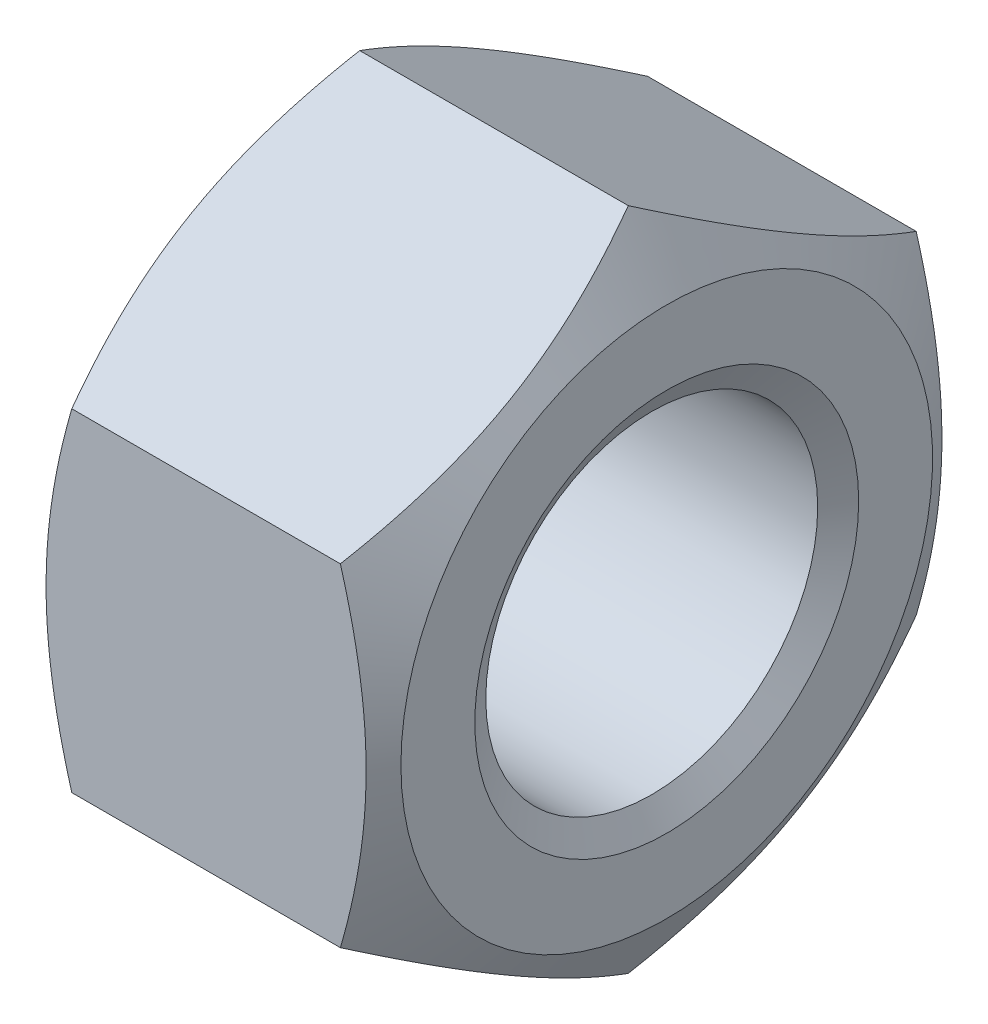
ISO-10303-21;
HEADER;
FILE_DESCRIPTION(('STEP AP214'),'2;1');
FILE_NAME('part.step','',(''),(''),'','','');
FILE_SCHEMA(('AUTOMOTIVE_DESIGN { 1 0 10303 214 1 1 1 1 }'));
ENDSEC;
DATA;
#1=APPLICATION_CONTEXT('core data for automotive mechanical design processes');
#2=APPLICATION_PROTOCOL_DEFINITION('international standard','automotive_design',2000,#1);
#3=PRODUCT_CONTEXT('',#1,'mechanical');
#4=PRODUCT('Part','Part','',(#3));
#5=PRODUCT_RELATED_PRODUCT_CATEGORY('part','',(#4));
#6=PRODUCT_DEFINITION_FORMATION('','',#4);
#7=PRODUCT_DEFINITION_CONTEXT('part definition',#1,'design');
#8=PRODUCT_DEFINITION('design','',#6,#7);
#9=PRODUCT_DEFINITION_SHAPE('','',#8);
#10=(LENGTH_UNIT() NAMED_UNIT(*) SI_UNIT(.MILLI.,.METRE.));
#11=(NAMED_UNIT(*) PLANE_ANGLE_UNIT() SI_UNIT($,.RADIAN.));
#12=(NAMED_UNIT(*) SI_UNIT($,.STERADIAN.) SOLID_ANGLE_UNIT());
#13=UNCERTAINTY_MEASURE_WITH_UNIT(LENGTH_MEASURE(1.E-05),#10,'distance_accuracy_value','');
#14=(GEOMETRIC_REPRESENTATION_CONTEXT(3) GLOBAL_UNCERTAINTY_ASSIGNED_CONTEXT((#13)) GLOBAL_UNIT_ASSIGNED_CONTEXT((#10,
#11,#12)) REPRESENTATION_CONTEXT('',''));
#15=CARTESIAN_POINT('',(0.,0.,0.));
#16=DIRECTION('',(0.,0.,1.));
#17=DIRECTION('',(1.,0.,0.));
#18=AXIS2_PLACEMENT_3D('',#15,#16,#17);
#19=CARTESIAN_POINT('',(0.,-8.66025403784439,15.));
#20=DIRECTION('',(0.,0.,1.));
#21=DIRECTION('',(1.,0.,0.));
#22=AXIS2_PLACEMENT_3D('',#19,#20,#21);
#23=PLANE('',#22);
#24=CARTESIAN_POINT('',(15.9963011937493,8.660254063965,14.9999999630089));
#25=CARTESIAN_POINT('',(16.1061892916723,8.27955805176889,14.9999999867127));
#26=CARTESIAN_POINT('',(16.2110906732579,7.8973771195246,14.9999999964389));
#27=CARTESIAN_POINT('',(16.4095339130489,7.1299506360908,15.0000000035623));
#28=CARTESIAN_POINT('',(16.5030720351486,6.74470412109461,15.0000000009555));
#29=CARTESIAN_POINT('',(16.6775313757609,5.97040202841399,14.9999999990423));
#30=CARTESIAN_POINT('',(16.7584227446316,5.58133967565635,14.9999999997436));
#31=CARTESIAN_POINT('',(16.9058515962837,4.80051152950205,15.0000000002564));
#32=CARTESIAN_POINT('',(16.9723898979275,4.40874589164828,15.0000000000679));
#33=CARTESIAN_POINT('',(17.0882825474242,3.63254947398829,14.9999999999338));
#34=CARTESIAN_POINT('',(17.1380204903809,3.2481763157973,14.9999999999823));
#35=CARTESIAN_POINT('',(17.2214190561365,2.47766883932699,15.0000000000177));
#36=CARTESIAN_POINT('',(17.2550793694428,2.09153448728932,15.0000000000047));
#37=CARTESIAN_POINT('',(17.3054727750993,1.31861723247655,14.9999999999953));
#38=CARTESIAN_POINT('',(17.3222259811158,0.93183564995136,14.9999999999987));
#39=CARTESIAN_POINT('',(17.3384448890553,0.157915577550444,15.0000000000013));
#40=CARTESIAN_POINT('',(17.3379111252395,-0.229222900925484,15.0000000000003));
#41=CARTESIAN_POINT('',(17.3207643973077,-0.952960295341789,14.9999999999997));
#42=CARTESIAN_POINT('',(17.3062429205895,-1.28961081806031,14.9999999999999));
#43=CARTESIAN_POINT('',(17.2644014873283,-1.96213746726976,15.0000000000001));
#44=CARTESIAN_POINT('',(17.2370806256529,-2.29801353730548,15.));
#45=CARTESIAN_POINT('',(17.1701167280641,-2.96880885483034,15.));
#46=CARTESIAN_POINT('',(17.1304635167625,-3.30372708086396,15.));
#47=CARTESIAN_POINT('',(17.0395305529228,-3.9719934466677,15.));
#48=CARTESIAN_POINT('',(16.9882500100784,-4.30534147813931,15.));
#49=CARTESIAN_POINT('',(16.8156711449723,-5.31723704559241,15.));
#50=CARTESIAN_POINT('',(16.6771657536101,-5.99285447418579,15.));
#51=CARTESIAN_POINT('',(16.3628161977205,-7.33401574451062,15.));
#52=CARTESIAN_POINT('',(16.1870458469186,-7.99957675415561,15.));
#53=CARTESIAN_POINT('',(15.9963012506991,-8.66025395057893,15.));
#54=B_SPLINE_CURVE_WITH_KNOTS('',3,(#24,#25,#26,#27,#28,#29,#30,#31,#32,#33,#34,#35,#36,#37,#38,
#39,#40,#41,#42,#43,#44,#45,#46,#47,#48,#49,#50,#51,#52,#53),.UNSPECIFIED.,.F.,.F.,(4,2,2,2,2,2,
2,2,2,2,2,2,2,2,4),(0.,1.18874621922039,2.37788223238764,3.5697838713477,4.76161749266067,
5.92403462257747,7.08647412799542,8.24752909256806,9.40854817428214,10.4191952677014,
11.4299138417013,12.4414685792605,13.4530920925149,15.5208227849199,17.5844953952228),.UNSPECIFIED.);
#55=CARTESIAN_POINT('',(15.9963012381152,8.6602540596811,14.9999999621777));
#56=VERTEX_POINT('',#55);
#57=CARTESIAN_POINT('',(15.9963012381152,-8.66025399417095,15.));
#58=VERTEX_POINT('',#57);
#59=EDGE_CURVE('E93',#56,#58,#54,.T.);
#60=ORIENTED_EDGE('',*,*,#59,.F.);
#61=DIRECTION('',(1.,0.,0.));
#62=VECTOR('',#61,1.);
#63=CARTESIAN_POINT('',(0.,8.66025403784439,15.));
#64=LINE('',#63,#62);
#65=CARTESIAN_POINT('',(2.00369876188478,8.66025399417095,15.));
#66=VERTEX_POINT('',#65);
#67=EDGE_CURVE('E81',#66,#56,#64,.T.);
#68=ORIENTED_EDGE('',*,*,#67,.F.);
#69=CARTESIAN_POINT('',(2.00369874896797,-8.6602539505868,15.0000000005119));
#70=CARTESIAN_POINT('',(1.89381066738444,-8.27955793654983,15.0000000001839));
#71=CARTESIAN_POINT('',(1.78890929354576,-7.8973770048332,15.0000000000493));
#72=CARTESIAN_POINT('',(1.59046606162721,-7.12995052446107,14.9999999999507));
#73=CARTESIAN_POINT('',(1.49692793965368,-6.74470401199874,14.9999999999868));
#74=CARTESIAN_POINT('',(1.32246860128811,-5.9704019238084,15.0000000000132));
#75=CARTESIAN_POINT('',(1.24157723454497,-5.58133957300542,15.0000000000035));
#76=CARTESIAN_POINT('',(1.09414838654588,-4.80051143092786,14.9999999999964));
#77=CARTESIAN_POINT('',(1.02761008642888,-4.4087457951959,14.9999999999991));
#78=CARTESIAN_POINT('',(0.911717439979394,-3.63254938150914,15.0000000000009));
#79=CARTESIAN_POINT('',(0.861979498550981,-3.24817622516761,15.0000000000002));
#80=CARTESIAN_POINT('',(0.778580935717531,-2.47766875244254,14.9999999999997));
#81=CARTESIAN_POINT('',(0.744920623806222,-2.09153440230053,14.9999999999999));
#82=CARTESIAN_POINT('',(0.694527220821771,-1.31861715138428,15.0000000000001));
#83=CARTESIAN_POINT('',(0.677774016080343,-0.931835570859997,15.));
#84=CARTESIAN_POINT('',(0.661555110518601,-0.157915502527917,15.));
#85=CARTESIAN_POINT('',(0.66208887543671,0.229222973880075,15.));
#86=CARTESIAN_POINT('',(0.679235605220383,0.952960363364715,15.));
#87=CARTESIAN_POINT('',(0.693757082672427,1.28961088322562,15.));
#88=CARTESIAN_POINT('',(0.735598517161812,1.96213752670373,15.));
#89=CARTESIAN_POINT('',(0.762919379331438,2.29801359386575,15.));
#90=CARTESIAN_POINT('',(0.829883277672793,2.96880890566205,15.));
#91=CARTESIAN_POINT('',(0.869536489233197,3.30372712884075,15.));
#92=CARTESIAN_POINT('',(0.960469453363144,3.9719934889467,15.));
#93=CARTESIAN_POINT('',(1.01174999623891,4.30534151757544,15.));
#94=CARTESIAN_POINT('',(1.18432886104483,5.31723707598233,15.));
#95=CARTESIAN_POINT('',(1.32283425171013,5.99285449841374,15.));
#96=CARTESIAN_POINT('',(1.63718380545329,7.33401575652142,15.));
#97=CARTESIAN_POINT('',(1.81295415480394,7.99957676011166,15.));
#98=CARTESIAN_POINT('',(2.00369874930085,8.66025395057893,15.));
#99=B_SPLINE_CURVE_WITH_KNOTS('',3,(#69,#70,#71,#72,#73,#74,#75,#76,#77,#78,#79,#80,#81,#82,#83,
#84,#85,#86,#87,#88,#89,#90,#91,#92,#93,#94,#95,#96,#97,#98),.UNSPECIFIED.,.F.,.F.,(4,2,2,2,2,2,
2,2,2,2,2,2,2,2,4),(0.,1.18874621155261,2.37788221738811,3.56978384922411,4.76161746353126,
5.92403458734604,7.08647408674257,8.24752904515595,9.40854812067755,10.4191952056337,
11.429913771168,12.4414685003197,13.4530920051647,15.52082267908,17.584495270756),.UNSPECIFIED.);
#100=CARTESIAN_POINT('',(2.00369877919387,-8.66025402970089,15.000000014105));
#101=VERTEX_POINT('',#100);
#102=EDGE_CURVE('E117',#101,#66,#99,.T.);
#103=ORIENTED_EDGE('',*,*,#102,.F.);
#104=DIRECTION('',(1.,0.,0.));
#105=VECTOR('',#104,1.);
#106=CARTESIAN_POINT('',(0.,-8.66025403784439,15.));
#107=LINE('',#106,#105);
#108=EDGE_CURVE('E96',#58,#101,#107,.F.);
#109=ORIENTED_EDGE('',*,*,#108,.F.);
#110=EDGE_LOOP('',(#60,#68,#103,#109));
#111=FACE_BOUND('',#110,.T.);
#112=ADVANCED_FACE('F17',(#111),#23,.T.);
#113=CARTESIAN_POINT('',(0.,8.66025403784438,15.));
#114=DIRECTION('',(0.,0.866025403784438,0.5));
#115=DIRECTION('',(0.,-0.5,0.866025403784438));
#116=AXIS2_PLACEMENT_3D('',#113,#114,#115);
#117=PLANE('',#116);
#118=CARTESIAN_POINT('',(15.9963012510316,17.3205080325035,7.58224326656842E-08));
#119=CARTESIAN_POINT('',(16.1061893326153,17.1301600252011,0.329692494933985));
#120=CARTESIAN_POINT('',(16.211090706454,16.9390695592262,0.660670890575329));
#121=CARTESIAN_POINT('',(16.4095339383726,16.5553563189548,1.32528171806523));
#122=CARTESIAN_POINT('',(16.5030720603461,16.3627330627549,1.65891498459501));
#123=CARTESIAN_POINT('',(16.6775313987117,15.9755820186826,2.32948026318444));
#124=CARTESIAN_POINT('',(16.7584227654549,15.7810508432727,2.66641814263108));
#125=CARTESIAN_POINT('',(16.905851613454,15.3906367722278,3.34263514965652));
#126=CARTESIAN_POINT('',(16.972389913571,15.194753954364,3.68191414253148));
#127=CARTESIAN_POINT('',(17.0882825600205,14.8066557475223,4.35411995511154));
#128=CARTESIAN_POINT('',(17.1380205014489,14.6144691693509,4.68699687303579));
#129=CARTESIAN_POINT('',(17.2214190642824,14.2292154329879,5.35427591822122));
#130=CARTESIAN_POINT('',(17.2550793761937,14.0361482579171,5.6886780747181));
#131=CARTESIAN_POINT('',(17.3054727791782,13.6496896324591,6.35804404903489));
#132=CARTESIAN_POINT('',(17.3222259839196,13.4562988421969,6.69300672348481));
#133=CARTESIAN_POINT('',(17.3384448894814,13.0693388080308,7.36324116315898));
#134=CARTESIAN_POINT('',(17.3379111245633,12.8757695698268,7.69851291851072));
#135=CARTESIAN_POINT('',(17.3207643947796,12.5139008750845,8.32528788347309));
#136=CARTESIAN_POINT('',(17.3062429173276,12.345575615154,8.61683578586988));
#137=CARTESIAN_POINT('',(17.2644014828382,12.0093122934149,9.19926094384384));
#138=CARTESIAN_POINT('',(17.2370806206686,11.8413742598339,9.49013815052937));
#139=CARTESIAN_POINT('',(17.1701167223272,11.5059766039357,10.0710639312845));
#140=CARTESIAN_POINT('',(17.1304635107668,11.3385174923464,10.3611116207476));
#141=CARTESIAN_POINT('',(17.0395305466369,11.0043843122934,10.939847265094));
#142=CARTESIAN_POINT('',(16.9882500037611,10.837710297979,11.2285351261879));
#143=CARTESIAN_POINT('',(16.8156711389552,10.3317625187755,12.104862385745));
#144=CARTESIAN_POINT('',(16.6771657482899,9.99395380755979,12.68996423681));
#145=CARTESIAN_POINT('',(16.3628161945467,9.32337317850591,13.8514439569028));
#146=CARTESIAN_POINT('',(16.1870458451961,8.99059267671077,14.4278366937803));
#147=CARTESIAN_POINT('',(15.9963012506991,8.66025408147711,14.9999999244259));
#148=B_SPLINE_CURVE_WITH_KNOTS('',3,(#118,#119,#120,#121,#122,#123,#124,#125,#126,#127,#128,
#129,#130,#131,#132,#133,#134,#135,#136,#137,#138,#139,#140,#141,#142,#143,#144,#145,#146,#147),
.UNSPECIFIED.,.F.,.F.,(4,2,2,2,2,2,2,2,2,2,2,2,2,2,4),(0.,1.18874621155266,2.37788221738822,
3.56978384922426,4.76161746353146,5.92403458734629,7.08647408674285,8.24752904515628,
9.40854812067792,10.4191952056341,11.4299137711685,12.4414685003202,13.4530920051653,
15.5208226790807,17.5844952707569),.UNSPECIFIED.);
#149=CARTESIAN_POINT('',(15.9963012208062,17.3205080838321,1.41045974625871E-08));
#150=VERTEX_POINT('',#149);
#151=EDGE_CURVE('E21',#150,#56,#148,.T.);
#152=ORIENTED_EDGE('',*,*,#151,.F.);
#153=DIRECTION('',(1.,0.,0.));
#154=VECTOR('',#153,1.);
#155=CARTESIAN_POINT('',(0.,17.3205080756888,0.));
#156=LINE('',#155,#154);
#157=CARTESIAN_POINT('',(2.0036987618849,17.3205080538523,3.78219504050924E-08));
#158=VERTEX_POINT('',#157);
#159=EDGE_CURVE('E74',#158,#150,#156,.T.);
#160=ORIENTED_EDGE('',*,*,#159,.F.);
#161=CARTESIAN_POINT('',(2.00369880625068,8.66025399274883,15.0000000041255));
#162=CARTESIAN_POINT('',(1.89381070832769,8.85060201937504,14.6703075982962));
#163=CARTESIAN_POINT('',(1.78890932674207,9.04169249392027,14.3393292069937));
#164=CARTESIAN_POINT('',(1.59046608695111,9.4254057418062,13.6747183803648));
#165=CARTESIAN_POINT('',(1.49692796485137,9.61802899704674,13.3410851103553));
#166=CARTESIAN_POINT('',(1.32246862423909,10.0051800417302,12.6705198269338));
#167=CARTESIAN_POINT('',(1.24157725536835,10.1997112187164,12.3335819461402));
#168=CARTESIAN_POINT('',(1.09414840371632,10.5901252922376,11.657364935837));
#169=CARTESIAN_POINT('',(1.02761010207252,10.7860081110012,11.3180859410316));
#170=CARTESIAN_POINT('',(0.911717452575764,11.1741063197151,10.6458801249445));
#171=CARTESIAN_POINT('',(0.861979509619128,11.3662928988526,10.3130032054425));
#172=CARTESIAN_POINT('',(0.778580943863529,11.7515466371184,9.64572415703114));
#173=CARTESIAN_POINT('',(0.744920630557182,11.944613813126,9.31132199888618));
#174=CARTESIAN_POINT('',(0.694527224900697,12.3310724405242,8.64195602119025));
#175=CARTESIAN_POINT('',(0.677774018884236,12.5244632317898,8.30699334500922));
#176=CARTESIAN_POINT('',(0.661555110944696,12.9114232679925,7.6367589018126));
#177=CARTESIAN_POINT('',(0.662088874760531,13.1049925072296,7.30148714466952));
#178=CARTESIAN_POINT('',(0.679235602692335,13.4668612044373,6.67471217543592));
#179=CARTESIAN_POINT('',(0.693757079410518,13.6351864657967,6.38316427056444));
#180=CARTESIAN_POINT('',(0.735598512671724,13.9714497904016,5.80073910762705));
#181=CARTESIAN_POINT('',(0.762919374347073,14.1393878254194,5.50986189845278));
#182=CARTESIAN_POINT('',(0.829883271935916,14.4747854841818,4.92893611273653));
#183=CARTESIAN_POINT('',(0.869536483237491,14.6422445971987,4.63888842080097));
#184=CARTESIAN_POINT('',(0.96046944707723,14.9763777801006,4.06015277152018));
#185=CARTESIAN_POINT('',(1.01174998992165,15.1430517958364,3.7714649079642));
#186=CARTESIAN_POINT('',(1.18432885502779,15.648999579563,2.89513764057286));
#187=CARTESIAN_POINT('',(1.32283424639005,15.9868082938597,2.31003578417142));
#188=CARTESIAN_POINT('',(1.63718380227968,16.6573889290222,1.14855605349819));
#189=CARTESIAN_POINT('',(1.81295415308155,16.9901694338448,0.57216331137716));
#190=CARTESIAN_POINT('',(2.00369874930107,17.3205080320564,7.55734243463697E-08));
#191=B_SPLINE_CURVE_WITH_KNOTS('',3,(#161,#162,#163,#164,#165,#166,#167,#168,#169,#170,#171,
#172,#173,#174,#175,#176,#177,#178,#179,#180,#181,#182,#183,#184,#185,#186,#187,#188,#189,#190),
.UNSPECIFIED.,.F.,.F.,(4,2,2,2,2,2,2,2,2,2,2,2,2,2,4),(0.,1.18874621922039,2.37788223238764,
3.5697838713477,4.76161749266067,5.92403462257747,7.08647412799541,8.24752909256805,
9.40854817428213,10.4191952677015,11.4299138417014,12.4414685792608,13.4530920925153,
15.5208227849205,17.5844953952236),.UNSPECIFIED.);
#192=EDGE_CURVE('E84',#66,#158,#191,.T.);
#193=ORIENTED_EDGE('',*,*,#192,.F.);
#194=ORIENTED_EDGE('',*,*,#67,.T.);
#195=EDGE_LOOP('',(#152,#160,#193,#194));
#196=FACE_BOUND('',#195,.T.);
#197=ADVANCED_FACE('F83',(#196),#117,.T.);
#198=CARTESIAN_POINT('',(0.,17.3205080756888,0.));
#199=DIRECTION('',(0.,0.866025403784439,-0.499999999999999));
#200=DIRECTION('',(0.,0.499999999999999,0.866025403784439));
#201=AXIS2_PLACEMENT_3D('',#198,#199,#200);
#202=PLANE('',#201);
#203=CARTESIAN_POINT('',(15.9963011937493,8.66025399274887,-15.0000000041255));
#204=CARTESIAN_POINT('',(16.1061892916776,8.85060201938431,-14.6703075982802));
#205=CARTESIAN_POINT('',(16.2110906732681,9.04169249393885,-14.3393292069616));
#206=CARTESIAN_POINT('',(16.4095339130676,9.42540574184354,-13.6747183803001));
#207=CARTESIAN_POINT('',(16.503072035171,9.61802899709353,-13.3410851102743));
#208=CARTESIAN_POINT('',(16.6775313757898,10.0051800417972,-12.6705198268178));
#209=CARTESIAN_POINT('',(16.7584227446633,10.1997112187942,-12.3335819460054));
#210=CARTESIAN_POINT('',(16.905851596319,10.5901252923371,-11.6573649356646));
#211=CARTESIAN_POINT('',(16.9723898979638,10.7860081111117,-11.3180859408403));
#212=CARTESIAN_POINT('',(17.0882825474545,11.1741063198272,-10.6458801247504));
#213=CARTESIAN_POINT('',(17.1380204904057,11.3662928989552,-10.3130032052648));
#214=CARTESIAN_POINT('',(17.2214190561519,11.7515466372019,-9.64572415688666));
#215=CARTESIAN_POINT('',(17.2550793694543,11.9446138131998,-9.31132199875852));
#216=CARTESIAN_POINT('',(17.3054727751044,12.3310724405774,-8.64195602109817));
#217=CARTESIAN_POINT('',(17.3222259811184,12.5244632318322,-8.30699334493588));
#218=CARTESIAN_POINT('',(17.3384448890553,12.9114232680134,-7.6367589017764));
#219=CARTESIAN_POINT('',(17.3379111252391,13.1049925072399,-7.3014871446517));
#220=CARTESIAN_POINT('',(17.3207643971936,13.4668612068432,-6.67471217126865));
#221=CARTESIAN_POINT('',(17.3062429201742,13.6351864706066,-6.38316426223349));
#222=CARTESIAN_POINT('',(17.26440148595,13.9714498000051,-5.80073909099337));
#223=CARTESIAN_POINT('',(17.2370806236128,14.1393878374126,-5.50986187768006));
#224=CARTESIAN_POINT('',(17.1701167243638,14.4747855009389,-4.92893608371255));
#225=CARTESIAN_POINT('',(17.1304635120633,14.6422446163298,-4.63888838766484));
#226=CARTESIAN_POINT('',(17.0395305459244,14.976377803951,-4.06015273021004));
#227=CARTESIAN_POINT('',(16.9882500017797,15.1430518220319,-3.77146486259223));
#228=CARTESIAN_POINT('',(16.8156711322713,15.6489996129869,-2.89513758268102));
#229=CARTESIAN_POINT('',(16.6771657373742,15.9868083321129,-2.310035717915));
#230=CARTESIAN_POINT('',(16.3628161736462,16.6573889767583,-1.14855597081694));
#231=CARTESIAN_POINT('',(16.1870458185454,16.990169486235,-0.572163220634544));
#232=CARTESIAN_POINT('',(15.9963012178031,17.3205080890337,2.31140362229883E-08));
#233=B_SPLINE_CURVE_WITH_KNOTS('',3,(#203,#204,#205,#206,#207,#208,#209,#210,#211,#212,#213,
#214,#215,#216,#217,#218,#219,#220,#221,#222,#223,#224,#225,#226,#227,#228,#229,#230,#231,#232),
.UNSPECIFIED.,.F.,.F.,(4,2,2,2,2,2,2,2,2,2,2,2,2,2,4),(0.,1.1887462192781,2.37788223250298,
3.56978387152813,4.76161749290619,5.92403462276464,7.08647412812357,8.24752909263087,
9.40854817428215,10.4191952821393,11.4299138705814,12.4414686226307,13.4530921503783,
15.5208228732595,17.5844955138065),.UNSPECIFIED.);
#234=CARTESIAN_POINT('',(15.9963012381152,8.66025399417098,-15.));
#235=VERTEX_POINT('',#234);
#236=EDGE_CURVE('E95',#235,#150,#233,.T.);
#237=ORIENTED_EDGE('',*,*,#236,.F.);
#238=DIRECTION('',(-1.,0.,0.));
#239=VECTOR('',#238,1.);
#240=CARTESIAN_POINT('',(0.,8.66025403784443,-15.));
#241=LINE('',#240,#239);
#242=CARTESIAN_POINT('',(2.00369876188478,8.66025405968115,-14.9999999621777));
#243=VERTEX_POINT('',#242);
#244=EDGE_CURVE('E190',#243,#235,#241,.F.);
#245=ORIENTED_EDGE('',*,*,#244,.F.);
#246=CARTESIAN_POINT('',(2.00369880625029,17.3205080567137,4.1115862395356E-08));
#247=CARTESIAN_POINT('',(1.89381070832741,17.1301600711436,-0.329692388417266));
#248=CARTESIAN_POINT('',(1.78890932674184,16.9390696134445,-0.66067078944587));
#249=CARTESIAN_POINT('',(1.59046608695094,16.5553563778966,-1.32528162319815));
#250=CARTESIAN_POINT('',(1.4969279648512,16.362733118141,-1.65891489060087));
#251=CARTESIAN_POINT('',(1.32246862423894,15.9755820701438,-2.32948017210912));
#252=CARTESIAN_POINT('',(1.24157725536821,15.7810508943724,-2.66641805360402));
#253=CARTESIAN_POINT('',(1.09414840371621,15.3906368217393,-3.34263506441992));
#254=CARTESIAN_POINT('',(1.02761010207242,15.1947540026492,-3.68191405903685));
#255=CARTESIAN_POINT('',(0.911717452575683,14.8066557937031,-4.35411987498979));
#256=CARTESIAN_POINT('',(0.861979509619056,14.6144692146496,-4.68699679454027));
#257=CARTESIAN_POINT('',(0.778580943863478,14.2292154764451,-5.35427584298712));
#258=CARTESIAN_POINT('',(0.744920630557141,14.0361483004151,-5.68867800111908));
#259=CARTESIAN_POINT('',(0.694527224900674,13.6496896730005,-6.35804397880549));
#260=CARTESIAN_POINT('',(0.677774018884223,13.4562988817409,-6.69300665498999));
#261=CARTESIAN_POINT('',(0.661555110944699,13.0693388455426,-7.36324109818911));
#262=CARTESIAN_POINT('',(0.662088874760542,12.8757696063039,-7.69851285533124));
#263=CARTESIAN_POINT('',(0.679235602692358,12.5139009090952,-8.32528782456419));
#264=CARTESIAN_POINT('',(0.693757079410545,12.3455756477361,-8.61683572943582));
#265=CARTESIAN_POINT('',(0.735598512671753,12.0093123231316,-9.19926089237326));
#266=CARTESIAN_POINT('',(0.762919374347099,11.8413742881137,-9.49013810154744));
#267=CARTESIAN_POINT('',(0.829883271935935,11.5059766293512,-10.0710638872636));
#268=CARTESIAN_POINT('',(0.869536483237506,11.3385175163344,-10.3611115791991));
#269=CARTESIAN_POINT('',(0.960469447077231,11.0043843334326,-10.9398472284798));
#270=CARTESIAN_POINT('',(1.01174998992164,10.8377103176968,-11.2285350920357));
#271=CARTESIAN_POINT('',(1.18432885502775,10.3317625339703,-12.1048623594269));
#272=CARTESIAN_POINT('',(1.32283424638997,9.99395381967363,-12.6899642158283));
#273=CARTESIAN_POINT('',(1.63718380227954,9.32337318451126,-13.8514439465013));
#274=CARTESIAN_POINT('',(1.81295415308137,8.99059267968879,-14.4278366886222));
#275=CARTESIAN_POINT('',(2.00369874930084,8.66025408147715,-14.9999999244259));
#276=B_SPLINE_CURVE_WITH_KNOTS('',3,(#246,#247,#248,#249,#250,#251,#252,#253,#254,#255,#256,
#257,#258,#259,#260,#261,#262,#263,#264,#265,#266,#267,#268,#269,#270,#271,#272,#273,#274,#275),
.UNSPECIFIED.,.F.,.F.,(4,2,2,2,2,2,2,2,2,2,2,2,2,2,4),(0.,1.18874621922034,2.37788223238754,
3.56978387134754,4.76161749266047,5.92403462257723,7.08647412799513,8.24752909256773,
9.40854817428176,10.419195267701,11.4299138417008,12.4414685792599,13.4530920925142,
15.5208227849192,17.5844953952219),.UNSPECIFIED.);
#277=EDGE_CURVE('E160',#158,#243,#276,.T.);
#278=ORIENTED_EDGE('',*,*,#277,.F.);
#279=ORIENTED_EDGE('',*,*,#159,.T.);
#280=EDGE_LOOP('',(#237,#245,#278,#279));
#281=FACE_BOUND('',#280,.T.);
#282=ADVANCED_FACE('F164',(#281),#202,.T.);
#283=CARTESIAN_POINT('',(0.,8.66025403784442,-15.));
#284=DIRECTION('',(0.,0.,-1.));
#285=DIRECTION('',(-1.,0.,0.));
#286=AXIS2_PLACEMENT_3D('',#283,#284,#285);
#287=PLANE('',#286);
#288=CARTESIAN_POINT('',(15.9963011937493,-8.66025406396494,-14.9999999630089));
#289=CARTESIAN_POINT('',(16.1061892916723,-8.27955805176883,-14.9999999867128));
#290=CARTESIAN_POINT('',(16.2110906732579,-7.89737711952454,-14.9999999964389));
#291=CARTESIAN_POINT('',(16.4095339130489,-7.12995063609074,-15.0000000035623));
#292=CARTESIAN_POINT('',(16.5030720351486,-6.74470412109454,-15.0000000009555));
#293=CARTESIAN_POINT('',(16.6775313757609,-5.97040202841394,-14.9999999990423));
#294=CARTESIAN_POINT('',(16.7584227446317,-5.5813396756563,-14.9999999997436));
#295=CARTESIAN_POINT('',(16.9058515962837,-4.800511529502,-15.0000000002564));
#296=CARTESIAN_POINT('',(16.9723898979275,-4.40874589164823,-15.0000000000679));
#297=CARTESIAN_POINT('',(17.0882825474242,-3.63254947398824,-14.9999999999338));
#298=CARTESIAN_POINT('',(17.1380204903809,-3.24817631579725,-14.9999999999823));
#299=CARTESIAN_POINT('',(17.2214190561365,-2.47766883932694,-15.0000000000177));
#300=CARTESIAN_POINT('',(17.2550793694428,-2.09153448728927,-15.0000000000047));
#301=CARTESIAN_POINT('',(17.3054727750993,-1.31861723247651,-14.9999999999953));
#302=CARTESIAN_POINT('',(17.3222259811158,-0.931835649951317,-14.9999999999987));
#303=CARTESIAN_POINT('',(17.3384448890553,-0.157915577550402,-15.0000000000013));
#304=CARTESIAN_POINT('',(17.3379111252395,0.229222900925525,-15.0000000000003));
#305=CARTESIAN_POINT('',(17.3207643973077,0.952960295341828,-14.9999999999997));
#306=CARTESIAN_POINT('',(17.3062429205895,1.28961081806035,-14.9999999999999));
#307=CARTESIAN_POINT('',(17.2644014873283,1.96213746726979,-15.0000000000001));
#308=CARTESIAN_POINT('',(17.2370806256529,2.29801353730552,-15.));
#309=CARTESIAN_POINT('',(17.1701167280641,2.96880885483037,-15.));
#310=CARTESIAN_POINT('',(17.1304635167625,3.30372708086399,-15.));
#311=CARTESIAN_POINT('',(17.0395305529228,3.97199344666773,-15.));
#312=CARTESIAN_POINT('',(16.9882500100784,4.30534147813934,-15.));
#313=CARTESIAN_POINT('',(16.8156711449723,5.31723704559243,-15.));
#314=CARTESIAN_POINT('',(16.6771657536101,5.99285447418581,-15.));
#315=CARTESIAN_POINT('',(16.3628161977205,7.33401574451064,-15.));
#316=CARTESIAN_POINT('',(16.1870458469186,7.99957675415563,-15.));
#317=CARTESIAN_POINT('',(15.9963012506991,8.66025395057895,-15.));
#318=B_SPLINE_CURVE_WITH_KNOTS('',3,(#288,#289,#290,#291,#292,#293,#294,#295,#296,#297,#298,
#299,#300,#301,#302,#303,#304,#305,#306,#307,#308,#309,#310,#311,#312,#313,#314,#315,#316,#317),
.UNSPECIFIED.,.F.,.F.,(4,2,2,2,2,2,2,2,2,2,2,2,2,2,4),(0.,1.18874621922039,2.37788223238763,
3.56978387134769,4.76161749266066,5.92403462257745,7.0864741279954,8.24752909256803,
9.40854817428211,10.4191952677014,11.4299138417012,12.4414685792604,13.4530920925148,
15.5208227849199,17.5844953952228),.UNSPECIFIED.);
#319=CARTESIAN_POINT('',(15.9963012381152,-8.66025405968106,-14.9999999621777));
#320=VERTEX_POINT('',#319);
#321=EDGE_CURVE('E175',#320,#235,#318,.T.);
#322=ORIENTED_EDGE('',*,*,#321,.F.);
#323=DIRECTION('',(1.,0.,0.));
#324=VECTOR('',#323,1.);
#325=CARTESIAN_POINT('',(0.,-8.66025403784434,-15.0000000000001));
#326=LINE('',#325,#324);
#327=CARTESIAN_POINT('',(2.00369876188478,-8.66025399417089,-15.));
#328=VERTEX_POINT('',#327);
#329=EDGE_CURVE('E188',#328,#320,#326,.T.);
#330=ORIENTED_EDGE('',*,*,#329,.F.);
#331=CARTESIAN_POINT('',(2.0036988062507,8.66025406396504,-14.9999999630089));
#332=CARTESIAN_POINT('',(1.89381070832771,8.27955805176892,-14.9999999867127));
#333=CARTESIAN_POINT('',(1.78890932674208,7.89737711952464,-14.9999999964389));
#334=CARTESIAN_POINT('',(1.59046608695113,7.12995063609084,-15.0000000035623));
#335=CARTESIAN_POINT('',(1.49692796485138,6.74470412109464,-15.0000000009555));
#336=CARTESIAN_POINT('',(1.32246862423911,5.97040202841403,-14.9999999990423));
#337=CARTESIAN_POINT('',(1.24157725536836,5.58133967565639,-14.9999999997436));
#338=CARTESIAN_POINT('',(1.09414840371633,4.80051152950208,-15.0000000002564));
#339=CARTESIAN_POINT('',(1.02761010207253,4.40874589164831,-15.0000000000679));
#340=CARTESIAN_POINT('',(0.911717452575771,3.63254947398832,-14.9999999999338));
#341=CARTESIAN_POINT('',(0.861979509619134,3.24817631579733,-14.9999999999823));
#342=CARTESIAN_POINT('',(0.778580943863533,2.47766883932702,-15.0000000000177));
#343=CARTESIAN_POINT('',(0.744920630557186,2.09153448728935,-15.0000000000047));
#344=CARTESIAN_POINT('',(0.694527224900699,1.31861723247658,-14.9999999999953));
#345=CARTESIAN_POINT('',(0.677774018884239,0.931835649951389,-14.9999999999987));
#346=CARTESIAN_POINT('',(0.661555110944698,0.157915577550473,-15.0000000000013));
#347=CARTESIAN_POINT('',(0.662088874760532,-0.229222900925456,-15.0000000000003));
#348=CARTESIAN_POINT('',(0.679235602692334,-0.952960295341759,-14.9999999999997));
#349=CARTESIAN_POINT('',(0.693757079410514,-1.28961081806028,-14.9999999999999));
#350=CARTESIAN_POINT('',(0.735598512671712,-1.96213746726972,-15.0000000000001));
#351=CARTESIAN_POINT('',(0.762919374347055,-2.29801353730545,-15.));
#352=CARTESIAN_POINT('',(0.829883271935885,-2.9688088548303,-15.));
#353=CARTESIAN_POINT('',(0.869536483237453,-3.30372708086392,-15.));
#354=CARTESIAN_POINT('',(0.960469447077175,-3.97199344666766,-15.));
#355=CARTESIAN_POINT('',(1.01174998992158,-4.30534147813926,-15.));
#356=CARTESIAN_POINT('',(1.1843288550277,-5.31723704559236,-15.));
#357=CARTESIAN_POINT('',(1.32283424638992,-5.99285447418573,-15.));
#358=CARTESIAN_POINT('',(1.6371838022795,-7.33401574451056,-15.));
#359=CARTESIAN_POINT('',(1.81295415308134,-7.99957675415555,-15.));
#360=CARTESIAN_POINT('',(2.00369874930083,-8.66025395057886,-15.));
#361=B_SPLINE_CURVE_WITH_KNOTS('',3,(#331,#332,#333,#334,#335,#336,#337,#338,#339,#340,#341,
#342,#343,#344,#345,#346,#347,#348,#349,#350,#351,#352,#353,#354,#355,#356,#357,#358,#359,#360),
.UNSPECIFIED.,.F.,.F.,(4,2,2,2,2,2,2,2,2,2,2,2,2,2,4),(0.,1.18874621922039,2.37788223238764,
3.5697838713477,4.76161749266068,5.92403462257748,7.08647412799543,8.24752909256807,
9.40854817428215,10.4191952677014,11.4299138417013,12.4414685792605,13.4530920925149,
15.5208227849199,17.5844953952228),.UNSPECIFIED.);
#362=EDGE_CURVE('E155',#243,#328,#361,.T.);
#363=ORIENTED_EDGE('',*,*,#362,.F.);
#364=ORIENTED_EDGE('',*,*,#244,.T.);
#365=EDGE_LOOP('',(#322,#330,#363,#364));
#366=FACE_BOUND('',#365,.T.);
#367=ADVANCED_FACE('F167',(#366),#287,.T.);
#368=CARTESIAN_POINT('',(0.,-8.66025403784434,-15.));
#369=DIRECTION('',(0.,-0.866025403784438,-0.500000000000001));
#370=DIRECTION('',(0.,0.500000000000001,-0.866025403784438));
#371=AXIS2_PLACEMENT_3D('',#368,#369,#370);
#372=PLANE('',#371);
#373=CARTESIAN_POINT('',(15.9963011937493,-17.3205080567138,4.11166647387145E-08));
#374=CARTESIAN_POINT('',(16.1061892916723,-17.1301600711439,-0.329692388416536));
#375=CARTESIAN_POINT('',(16.2110906732579,-16.9390696134449,-0.660670789445176));
#376=CARTESIAN_POINT('',(16.4095339130489,-16.555356377897,-1.3252816231975));
#377=CARTESIAN_POINT('',(16.5030720351486,-16.3627331181413,-1.65891489060023));
#378=CARTESIAN_POINT('',(16.6775313757609,-15.9755820701442,-2.3294801721085));
#379=CARTESIAN_POINT('',(16.7584227446316,-15.7810508943727,-2.66641805360341));
#380=CARTESIAN_POINT('',(16.9058515962837,-15.3906368217396,-3.34263506441933));
#381=CARTESIAN_POINT('',(16.9723898979275,-15.1947540026495,-3.68191405903627));
#382=CARTESIAN_POINT('',(17.0882825474242,-14.8066557937034,-4.35411987498924));
#383=CARTESIAN_POINT('',(17.1380204903809,-14.6144692146499,-4.68699679453973));
#384=CARTESIAN_POINT('',(17.2214190561365,-14.2292154764454,-5.3542758429866));
#385=CARTESIAN_POINT('',(17.2550793694428,-14.0361483004153,-5.68867800111857));
#386=CARTESIAN_POINT('',(17.3054727750993,-13.6496896730007,-6.358043978805));
#387=CARTESIAN_POINT('',(17.3222259811158,-13.4562988817412,-6.69300665498951));
#388=CARTESIAN_POINT('',(17.3384448890553,-13.0693388455429,-7.36324109818866));
#389=CARTESIAN_POINT('',(17.3379111252395,-12.8757696063041,-7.6985128553308));
#390=CARTESIAN_POINT('',(17.3207643973077,-12.5139009090954,-8.32528782456378));
#391=CARTESIAN_POINT('',(17.3062429205895,-12.3455756477363,-8.61683572943543));
#392=CARTESIAN_POINT('',(17.2644014873283,-12.0093123231318,-9.19926089237291));
#393=CARTESIAN_POINT('',(17.2370806256529,-11.8413742881138,-9.49013810154711));
#394=CARTESIAN_POINT('',(17.1701167280641,-11.5059766293514,-10.0710638872633));
#395=CARTESIAN_POINT('',(17.1304635167625,-11.3385175163346,-10.3611115791988));
#396=CARTESIAN_POINT('',(17.0395305529228,-11.0043843334327,-10.9398472284796));
#397=CARTESIAN_POINT('',(16.9882500100784,-10.8377103176969,-11.2285350920355));
#398=CARTESIAN_POINT('',(16.8156711449723,-10.3317625339703,-12.1048623594268));
#399=CARTESIAN_POINT('',(16.6771657536101,-9.99395381967365,-12.6899642158281));
#400=CARTESIAN_POINT('',(16.3628161977205,-9.32337318451124,-13.8514439465013));
#401=CARTESIAN_POINT('',(16.1870458469186,-8.99059267968874,-14.4278366886223));
#402=CARTESIAN_POINT('',(15.9963012506991,-8.66025408147707,-14.9999999244259));
#403=B_SPLINE_CURVE_WITH_KNOTS('',3,(#373,#374,#375,#376,#377,#378,#379,#380,#381,#382,#383,
#384,#385,#386,#387,#388,#389,#390,#391,#392,#393,#394,#395,#396,#397,#398,#399,#400,#401,#402),
.UNSPECIFIED.,.F.,.F.,(4,2,2,2,2,2,2,2,2,2,2,2,2,2,4),(0.,1.18874621922039,2.37788223238764,
3.5697838713477,4.76161749266067,5.92403462257747,7.08647412799542,8.24752909256806,
9.40854817428214,10.4191952677014,11.4299138417013,12.4414685792605,13.4530920925149,
15.52082278492,17.5844953952229),.UNSPECIFIED.);
#404=CARTESIAN_POINT('',(15.9963012381152,-17.3205080538521,3.78223056788825E-08));
#405=VERTEX_POINT('',#404);
#406=EDGE_CURVE('E99',#405,#320,#403,.T.);
#407=ORIENTED_EDGE('',*,*,#406,.F.);
#408=DIRECTION('',(1.,0.,0.));
#409=VECTOR('',#408,1.);
#410=CARTESIAN_POINT('',(0.,-17.3205080756888,0.));
#411=LINE('',#410,#409);
#412=CARTESIAN_POINT('',(2.00369876188478,-17.3205080538521,-3.78223187715068E-08));
#413=VERTEX_POINT('',#412);
#414=EDGE_CURVE('E192',#413,#405,#411,.T.);
#415=ORIENTED_EDGE('',*,*,#414,.F.);
#416=CARTESIAN_POINT('',(2.00369880625071,-8.66025399274878,-15.0000000041256));
#417=CARTESIAN_POINT('',(1.89381070832771,-8.850602019375,-14.6703075982963));
#418=CARTESIAN_POINT('',(1.78890932674208,-9.04169249392023,-14.3393292069938));
#419=CARTESIAN_POINT('',(1.59046608695112,-9.42540574180616,-13.6747183803648));
#420=CARTESIAN_POINT('',(1.49692796485138,-9.61802899704671,-13.3410851103553));
#421=CARTESIAN_POINT('',(1.3224686242391,-10.0051800417301,-12.6705198269338));
#422=CARTESIAN_POINT('',(1.24157725536836,-10.1997112187163,-12.3335819461402));
#423=CARTESIAN_POINT('',(1.09414840371633,-10.5901252922376,-11.6573649358371));
#424=CARTESIAN_POINT('',(1.02761010207253,-10.7860081110012,-11.3180859410317));
#425=CARTESIAN_POINT('',(0.911717452575768,-11.174106319715,-10.6458801249446));
#426=CARTESIAN_POINT('',(0.861979509619132,-11.3662928988525,-10.3130032054426));
#427=CARTESIAN_POINT('',(0.778580943863531,-11.7515466371184,-9.64572415703119));
#428=CARTESIAN_POINT('',(0.744920630557184,-11.944613813126,-9.31132199888622));
#429=CARTESIAN_POINT('',(0.694527224900697,-12.3310724405242,-8.64195602119029));
#430=CARTESIAN_POINT('',(0.677774018884236,-12.5244632317898,-8.30699334500926));
#431=CARTESIAN_POINT('',(0.661555110944695,-12.9114232679924,-7.63675890181264));
#432=CARTESIAN_POINT('',(0.662088874760529,-13.1049925072296,-7.30148714466956));
#433=CARTESIAN_POINT('',(0.679235602692331,-13.4668612044372,-6.67471217543599));
#434=CARTESIAN_POINT('',(0.693757079410511,-13.6351864657966,-6.38316427056454));
#435=CARTESIAN_POINT('',(0.735598512671711,-13.9714497904015,-5.80073910762721));
#436=CARTESIAN_POINT('',(0.762919374347054,-14.1393878254193,-5.50986189845296));
#437=CARTESIAN_POINT('',(0.829883271935886,-14.4747854841817,-4.92893611273676));
#438=CARTESIAN_POINT('',(0.869536483237454,-14.6422445971985,-4.63888842080123));
#439=CARTESIAN_POINT('',(0.960469447077178,-14.9763777801004,-4.06015277152049));
#440=CARTESIAN_POINT('',(1.01174998992159,-15.1430517958362,-3.77146490796455));
#441=CARTESIAN_POINT('',(1.1843288550277,-15.6489995795628,-2.89513764057329));
#442=CARTESIAN_POINT('',(1.32283424638993,-15.9868082938595,-2.3100357841719));
#443=CARTESIAN_POINT('',(1.63718380227951,-16.6573889290219,-1.14855605349879));
#444=CARTESIAN_POINT('',(1.81295415308135,-16.9901694338444,-0.572163311377805));
#445=CARTESIAN_POINT('',(2.00369874930084,-17.320508032056,-7.55741240640067E-08));
#446=B_SPLINE_CURVE_WITH_KNOTS('',3,(#416,#417,#418,#419,#420,#421,#422,#423,#424,#425,#426,
#427,#428,#429,#430,#431,#432,#433,#434,#435,#436,#437,#438,#439,#440,#441,#442,#443,#444,#445),
.UNSPECIFIED.,.F.,.F.,(4,2,2,2,2,2,2,2,2,2,2,2,2,2,4),(0.,1.1887462192204,2.37788223238764,
3.5697838713477,4.76161749266068,5.92403462257748,7.08647412799543,8.24752909256807,
9.40854817428215,10.4191952677014,11.4299138417013,12.4414685792605,13.4530920925149,
15.52082278492,17.5844953952229),.UNSPECIFIED.);
#447=EDGE_CURVE('E41',#328,#413,#446,.T.);
#448=ORIENTED_EDGE('',*,*,#447,.F.);
#449=ORIENTED_EDGE('',*,*,#329,.T.);
#450=EDGE_LOOP('',(#407,#415,#448,#449));
#451=FACE_BOUND('',#450,.T.);
#452=ADVANCED_FACE('F171',(#451),#372,.T.);
#453=CARTESIAN_POINT('',(0.,-17.3205080756888,0.));
#454=DIRECTION('',(0.,-0.866025403784439,0.5));
#455=DIRECTION('',(0.,-0.5,-0.866025403784439));
#456=AXIS2_PLACEMENT_3D('',#453,#454,#455);
#457=PLANE('',#456);
#458=CARTESIAN_POINT('',(15.9963011937493,-8.66025399274884,15.0000000041255));
#459=CARTESIAN_POINT('',(16.1061892916723,-8.85060201937505,14.6703075982962));
#460=CARTESIAN_POINT('',(16.2110906732579,-9.04169249392028,14.3393292069937));
#461=CARTESIAN_POINT('',(16.4095339130489,-9.42540574180621,13.6747183803648));
#462=CARTESIAN_POINT('',(16.5030720351486,-9.61802899704676,13.3410851103553));
#463=CARTESIAN_POINT('',(16.6775313757609,-10.0051800417302,12.6705198269338));
#464=CARTESIAN_POINT('',(16.7584227446316,-10.1997112187164,12.3335819461402));
#465=CARTESIAN_POINT('',(16.9058515962837,-10.5901252922376,11.657364935837));
#466=CARTESIAN_POINT('',(16.9723898979275,-10.7860081110013,11.3180859410316));
#467=CARTESIAN_POINT('',(17.0882825474242,-11.1741063197151,10.6458801249445));
#468=CARTESIAN_POINT('',(17.1380204903809,-11.3662928988526,10.3130032054425));
#469=CARTESIAN_POINT('',(17.2214190561365,-11.7515466371185,9.64572415703114));
#470=CARTESIAN_POINT('',(17.2550793694428,-11.944613813126,9.31132199888617));
#471=CARTESIAN_POINT('',(17.3054727750993,-12.3310724405242,8.64195602119024));
#472=CARTESIAN_POINT('',(17.3222259811158,-12.5244632317898,8.30699334500922));
#473=CARTESIAN_POINT('',(17.3384448890553,-12.9114232679925,7.6367589018126));
#474=CARTESIAN_POINT('',(17.3379111252395,-13.1049925072296,7.30148714466952));
#475=CARTESIAN_POINT('',(17.3207643973077,-13.4668612044372,6.67471217543594));
#476=CARTESIAN_POINT('',(17.3062429205895,-13.6351864657967,6.38316427056449));
#477=CARTESIAN_POINT('',(17.2644014873283,-13.9714497904015,5.80073910762717));
#478=CARTESIAN_POINT('',(17.2370806256529,-14.1393878254193,5.50986189845292));
#479=CARTESIAN_POINT('',(17.1701167280641,-14.4747854841817,4.92893611273672));
#480=CARTESIAN_POINT('',(17.1304635167625,-14.6422445971986,4.6388884208012));
#481=CARTESIAN_POINT('',(17.0395305529228,-14.9763777801004,4.06015277152046));
#482=CARTESIAN_POINT('',(16.9882500100784,-15.1430517958362,3.77146490796451));
#483=CARTESIAN_POINT('',(16.8156711449723,-15.6489995795628,2.89513764057326));
#484=CARTESIAN_POINT('',(16.6771657536101,-15.9868082938595,2.31003578417187));
#485=CARTESIAN_POINT('',(16.3628161977205,-16.6573889290219,1.14855605349876));
#486=CARTESIAN_POINT('',(16.1870458469186,-16.9901694338444,0.572163311377786));
#487=CARTESIAN_POINT('',(15.9963012506991,-17.320508032056,7.55741086533756E-08));
#488=B_SPLINE_CURVE_WITH_KNOTS('',3,(#458,#459,#460,#461,#462,#463,#464,#465,#466,#467,#468,
#469,#470,#471,#472,#473,#474,#475,#476,#477,#478,#479,#480,#481,#482,#483,#484,#485,#486,#487),
.UNSPECIFIED.,.F.,.F.,(4,2,2,2,2,2,2,2,2,2,2,2,2,2,4),(0.,1.18874621922039,2.37788223238764,
3.56978387134769,4.76161749266067,5.92403462257747,7.08647412799541,8.24752909256806,
9.40854817428213,10.4191952677014,11.4299138417012,12.4414685792605,13.4530920925148,
15.5208227849199,17.5844953952228),.UNSPECIFIED.);
#489=EDGE_CURVE('E98',#58,#405,#488,.T.);
#490=ORIENTED_EDGE('',*,*,#489,.F.);
#491=ORIENTED_EDGE('',*,*,#108,.T.);
#492=CARTESIAN_POINT('',(2.0036988062507,-17.3205080567138,-4.11166791771836E-08));
#493=CARTESIAN_POINT('',(1.89381070832236,-17.1301600711347,0.329692388432527));
#494=CARTESIAN_POINT('',(1.78890932673189,-16.9390696134263,0.660670789477301));
#495=CARTESIAN_POINT('',(1.59046608693241,-16.5553563778597,1.32528162326211));
#496=CARTESIAN_POINT('',(1.496927964829,-16.3627331180946,1.65891489068119));
#497=CARTESIAN_POINT('',(1.32246862421022,-15.9755820700772,2.32948017222452));
#498=CARTESIAN_POINT('',(1.24157725533673,-15.7810508942949,2.66641805373814));
#499=CARTESIAN_POINT('',(1.09414840368099,-15.3906368216401,3.34263506459172));
#500=CARTESIAN_POINT('',(1.02761010203623,-15.1947540025391,3.68191405922759));
#501=CARTESIAN_POINT('',(0.911717452545536,-14.8066557935913,4.35411987518331));
#502=CARTESIAN_POINT('',(0.861979509594311,-14.6144692145473,4.68699679471741));
#503=CARTESIAN_POINT('',(0.778580943848089,-14.229215476362,5.35427584313106));
#504=CARTESIAN_POINT('',(0.744920630545699,-14.0361483003417,5.68867800124621));
#505=CARTESIAN_POINT('',(0.694527224895642,-13.6496896729476,6.35804397889707));
#506=CARTESIAN_POINT('',(0.677774018881563,-13.4562988816988,6.69300665506283));
#507=CARTESIAN_POINT('',(0.661555110944725,-13.069338845522,7.36324109822485));
#508=CARTESIAN_POINT('',(0.662088874760919,-12.8757696062938,7.69851285534859));
#509=CARTESIAN_POINT('',(0.67923560280643,-12.5139009066895,8.32528782873108));
#510=CARTESIAN_POINT('',(0.693757079825758,-12.3455756429264,8.61683573776648));
#511=CARTESIAN_POINT('',(0.735598514049965,-12.0093123135282,9.1992609090068));
#512=CARTESIAN_POINT('',(0.762919376387237,-11.8413742761206,9.49013812232008));
#513=CARTESIAN_POINT('',(0.829883275636229,-11.5059766125942,10.0710639162876));
#514=CARTESIAN_POINT('',(0.869536487936744,-11.3385174972032,10.3611116123354));
#515=CARTESIAN_POINT('',(0.960469454075632,-11.004384309582,10.9398472697902));
#516=CARTESIAN_POINT('',(1.0117499982203,-10.8377102915011,11.2285351374081));
#517=CARTESIAN_POINT('',(1.1843288677288,-10.331762500546,12.1048624173194));
#518=CARTESIAN_POINT('',(1.32283426262589,-9.99395378142001,12.6899642820854));
#519=CARTESIAN_POINT('',(1.637183826354,-9.32337313677458,13.8514440291836));
#520=CARTESIAN_POINT('',(1.81295418145482,-8.99059262729779,14.4278367793661));
#521=CARTESIAN_POINT('',(2.00369878219712,-8.6602540244991,15.0000000231147));
#522=B_SPLINE_CURVE_WITH_KNOTS('',3,(#492,#493,#494,#495,#496,#497,#498,#499,#500,#501,#502,
#503,#504,#505,#506,#507,#508,#509,#510,#511,#512,#513,#514,#515,#516,#517,#518,#519,#520,#521),
.UNSPECIFIED.,.F.,.F.,(4,2,2,2,2,2,2,2,2,2,2,2,2,2,4),(0.,1.1887462192781,2.37788223250298,
3.56978387152814,4.76161749290619,5.92403462276464,7.08647412812357,8.24752909263088,
9.40854817428215,10.4191952821394,11.4299138705817,12.4414686226311,13.4530921503787,
15.5208228732601,17.5844955138074),.UNSPECIFIED.);
#523=EDGE_CURVE('E143',#413,#101,#522,.T.);
#524=ORIENTED_EDGE('',*,*,#523,.F.);
#525=ORIENTED_EDGE('',*,*,#414,.T.);
#526=EDGE_LOOP('',(#490,#491,#524,#525));
#527=FACE_BOUND('',#526,.T.);
#528=ADVANCED_FACE('F211',(#527),#457,.T.);
#529=CARTESIAN_POINT('',(15.9842790335447,0.,0.));
#530=DIRECTION('',(-1.,0.,0.));
#531=DIRECTION('',(0.,0.,1.));
#532=AXIS2_PLACEMENT_3D('',#529,#530,#531);
#533=CONICAL_SURFACE('',#532,17.3413311229297,1.04719755);
#534=CARTESIAN_POINT('',(18.0000000020764,0.,0.));
#535=DIRECTION('',(-1.,0.,0.));
#536=DIRECTION('',(0.,0.,1.));
#537=AXIS2_PLACEMENT_3D('',#534,#535,#536);
#538=CIRCLE('',#537,13.8500000011988);
#539=CARTESIAN_POINT('',(18.0000000020764,0.,13.8500000011988));
#540=VERTEX_POINT('',#539);
#541=EDGE_CURVE('E205',#540,#540,#538,.F.);
#542=ORIENTED_EDGE('',*,*,#541,.F.);
#543=EDGE_LOOP('',(#542));
#544=FACE_BOUND('',#543,.T.);
#545=ORIENTED_EDGE('',*,*,#321,.T.);
#546=ORIENTED_EDGE('',*,*,#236,.T.);
#547=ORIENTED_EDGE('',*,*,#151,.T.);
#548=ORIENTED_EDGE('',*,*,#59,.T.);
#549=ORIENTED_EDGE('',*,*,#489,.T.);
#550=ORIENTED_EDGE('',*,*,#406,.T.);
#551=EDGE_LOOP('',(#545,#546,#547,#548,#549,#550));
#552=FACE_BOUND('',#551,.T.);
#553=ADVANCED_FACE('F91',(#544,#552),#533,.T.);
#554=CARTESIAN_POINT('',(2.01572096645534,0.,0.));
#555=DIRECTION('',(1.,0.,0.));
#556=DIRECTION('',(0.,0.,-1.));
#557=AXIS2_PLACEMENT_3D('',#554,#555,#556);
#558=CONICAL_SURFACE('',#557,17.3413311229297,1.04719755);
#559=CARTESIAN_POINT('',(-2.07640111701823E-09,0.,0.));
#560=DIRECTION('',(1.,0.,0.));
#561=DIRECTION('',(0.,0.,-1.));
#562=AXIS2_PLACEMENT_3D('',#559,#560,#561);
#563=CIRCLE('',#562,13.8500000011988);
#564=CARTESIAN_POINT('',(-2.07640111701823E-09,0.,-13.8500000011988));
#565=VERTEX_POINT('',#564);
#566=EDGE_CURVE('E203',#565,#565,#563,.T.);
#567=ORIENTED_EDGE('',*,*,#566,.T.);
#568=EDGE_LOOP('',(#567));
#569=FACE_BOUND('',#568,.T.);
#570=ORIENTED_EDGE('',*,*,#447,.T.);
#571=ORIENTED_EDGE('',*,*,#523,.T.);
#572=ORIENTED_EDGE('',*,*,#102,.T.);
#573=ORIENTED_EDGE('',*,*,#192,.T.);
#574=ORIENTED_EDGE('',*,*,#277,.T.);
#575=ORIENTED_EDGE('',*,*,#362,.T.);
#576=EDGE_LOOP('',(#570,#571,#572,#573,#574,#575));
#577=FACE_BOUND('',#576,.T.);
#578=ADVANCED_FACE('F131',(#569,#577),#558,.T.);
#579=CARTESIAN_POINT('',(18.,0.,0.));
#580=DIRECTION('',(1.,0.,0.));
#581=DIRECTION('',(0.,0.,-1.));
#582=AXIS2_PLACEMENT_3D('',#579,#580,#581);
#583=PLANE('',#582);
#584=CARTESIAN_POINT('',(18.0000000008096,0.,0.));
#585=DIRECTION('',(1.,0.,0.));
#586=DIRECTION('',(0.,0.,-1.));
#587=AXIS2_PLACEMENT_3D('',#584,#585,#586);
#588=CIRCLE('',#587,10.0001646929458);
#589=CARTESIAN_POINT('',(18.0000000008096,0.,-10.0001646929458));
#590=VERTEX_POINT('',#589);
#591=EDGE_CURVE('E200',#590,#590,#588,.F.);
#592=ORIENTED_EDGE('',*,*,#591,.T.);
#593=EDGE_LOOP('',(#592));
#594=FACE_BOUND('',#593,.T.);
#595=ORIENTED_EDGE('',*,*,#541,.T.);
#596=EDGE_LOOP('',(#595));
#597=FACE_BOUND('',#596,.T.);
#598=ADVANCED_FACE('F135',(#594,#597),#583,.T.);
#599=CARTESIAN_POINT('',(0.,0.,0.));
#600=DIRECTION('',(1.,0.,0.));
#601=DIRECTION('',(0.,0.,-1.));
#602=AXIS2_PLACEMENT_3D('',#599,#600,#601);
#603=PLANE('',#602);
#604=CARTESIAN_POINT('',(-8.09596179418783E-10,0.,0.));
#605=DIRECTION('',(-1.,0.,0.));
#606=DIRECTION('',(0.,0.,1.));
#607=AXIS2_PLACEMENT_3D('',#604,#605,#606);
#608=CIRCLE('',#607,10.0001646929458);
#609=CARTESIAN_POINT('',(-8.09596179418783E-10,0.,10.0001646929458));
#610=VERTEX_POINT('',#609);
#611=EDGE_CURVE('E197',#610,#610,#608,.F.);
#612=ORIENTED_EDGE('',*,*,#611,.T.);
#613=EDGE_LOOP('',(#612));
#614=FACE_BOUND('',#613,.T.);
#615=ORIENTED_EDGE('',*,*,#566,.F.);
#616=EDGE_LOOP('',(#615));
#617=FACE_BOUND('',#616,.T.);
#618=ADVANCED_FACE('F237',(#614,#617),#603,.F.);
#619=CARTESIAN_POINT('',(18.0000000008096,0.,0.));
#620=DIRECTION('',(1.,0.,0.));
#621=DIRECTION('',(0.,0.,-1.));
#622=AXIS2_PLACEMENT_3D('',#619,#620,#621);
#623=CONICAL_SURFACE('',#622,10.0001646929458,1.04719755);
#624=ORIENTED_EDGE('',*,*,#591,.F.);
#625=EDGE_LOOP('',(#624));
#626=FACE_BOUND('',#625,.T.);
#627=CARTESIAN_POINT('',(17.21875,0.,0.));
#628=DIRECTION('',(-1.,0.,0.));
#629=DIRECTION('',(0.,-1.,0.));
#630=AXIS2_PLACEMENT_3D('',#627,#628,#629);
#631=CIRCLE('',#630,8.647);
#632=CARTESIAN_POINT('',(17.21875,-8.647,0.));
#633=VERTEX_POINT('',#632);
#634=EDGE_CURVE('E32',#633,#633,#631,.T.);
#635=ORIENTED_EDGE('',*,*,#634,.T.);
#636=EDGE_LOOP('',(#635));
#637=FACE_BOUND('',#636,.T.);
#638=ADVANCED_FACE('F221',(#626,#637),#623,.F.);
#639=CARTESIAN_POINT('',(-8.09597180961852E-10,0.,0.));
#640=DIRECTION('',(-1.,0.,0.));
#641=DIRECTION('',(0.,0.,1.));
#642=AXIS2_PLACEMENT_3D('',#639,#640,#641);
#643=CONICAL_SURFACE('',#642,10.0001646929458,1.04719755);
#644=ORIENTED_EDGE('',*,*,#611,.F.);
#645=EDGE_LOOP('',(#644));
#646=FACE_BOUND('',#645,.T.);
#647=CARTESIAN_POINT('',(0.78125,0.,0.));
#648=DIRECTION('',(1.,0.,0.));
#649=DIRECTION('',(0.,1.,0.));
#650=AXIS2_PLACEMENT_3D('',#647,#648,#649);
#651=CIRCLE('',#650,8.647);
#652=CARTESIAN_POINT('',(0.78125,8.647,0.));
#653=VERTEX_POINT('',#652);
#654=EDGE_CURVE('E11',#653,#653,#651,.T.);
#655=ORIENTED_EDGE('',*,*,#654,.T.);
#656=EDGE_LOOP('',(#655));
#657=FACE_BOUND('',#656,.T.);
#658=ADVANCED_FACE('F224',(#646,#657),#643,.F.);
#659=CARTESIAN_POINT('',(17.21875,0.,0.));
#660=DIRECTION('',(-1.,0.,0.));
#661=DIRECTION('',(0.,-1.,0.));
#662=AXIS2_PLACEMENT_3D('',#659,#660,#661);
#663=CYLINDRICAL_SURFACE('',#662,8.647);
#664=ORIENTED_EDGE('',*,*,#654,.F.);
#665=EDGE_LOOP('',(#664));
#666=FACE_BOUND('',#665,.T.);
#667=ORIENTED_EDGE('',*,*,#634,.F.);
#668=EDGE_LOOP('',(#667));
#669=FACE_BOUND('',#668,.T.);
#670=ADVANCED_FACE('F19',(#666,#669),#663,.F.);
#671=CLOSED_SHELL('',(#112,#197,#282,#367,#452,#528,#553,#578,#598,#618,#638,#658,#670));
#672=MANIFOLD_SOLID_BREP('B1',#671);
#673=ADVANCED_BREP_SHAPE_REPRESENTATION('',(#18,#672),#14);
#674=SHAPE_DEFINITION_REPRESENTATION(#9,#673);
ENDSEC;
END-ISO-10303-21;
